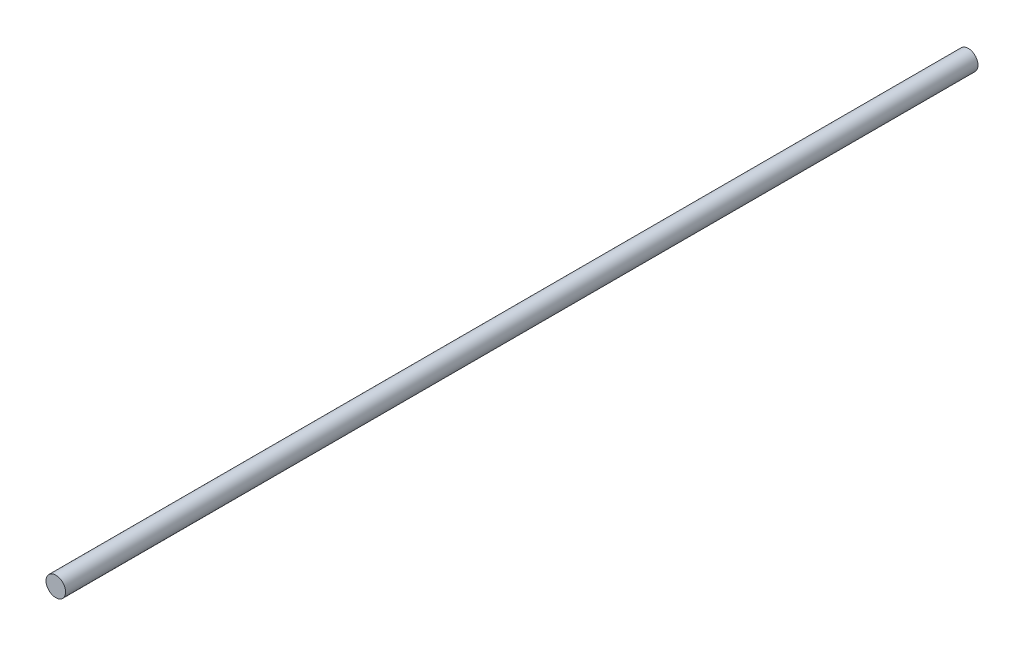
ISO-10303-21;
HEADER;
FILE_DESCRIPTION(('STEP AP214'),'2;1');
FILE_NAME('part.step','',(''),(''),'','','');
FILE_SCHEMA(('AUTOMOTIVE_DESIGN { 1 0 10303 214 1 1 1 1 }'));
ENDSEC;
DATA;
#1=APPLICATION_CONTEXT('core data for automotive mechanical design processes');
#2=APPLICATION_PROTOCOL_DEFINITION('international standard','automotive_design',2000,#1);
#3=PRODUCT_CONTEXT('',#1,'mechanical');
#4=PRODUCT('Part','Part','',(#3));
#5=PRODUCT_RELATED_PRODUCT_CATEGORY('part','',(#4));
#6=PRODUCT_DEFINITION_FORMATION('','',#4);
#7=PRODUCT_DEFINITION_CONTEXT('part definition',#1,'design');
#8=PRODUCT_DEFINITION('design','',#6,#7);
#9=PRODUCT_DEFINITION_SHAPE('','',#8);
#10=(LENGTH_UNIT() NAMED_UNIT(*) SI_UNIT(.MILLI.,.METRE.));
#11=(NAMED_UNIT(*) PLANE_ANGLE_UNIT() SI_UNIT($,.RADIAN.));
#12=(NAMED_UNIT(*) SI_UNIT($,.STERADIAN.) SOLID_ANGLE_UNIT());
#13=UNCERTAINTY_MEASURE_WITH_UNIT(LENGTH_MEASURE(1.E-05),#10,'distance_accuracy_value','');
#14=(GEOMETRIC_REPRESENTATION_CONTEXT(3) GLOBAL_UNCERTAINTY_ASSIGNED_CONTEXT((#13)) GLOBAL_UNIT_ASSIGNED_CONTEXT((#10,
#11,#12)) REPRESENTATION_CONTEXT('',''));
#15=CARTESIAN_POINT('',(0.,0.,0.));
#16=DIRECTION('',(0.,0.,1.));
#17=DIRECTION('',(1.,0.,0.));
#18=AXIS2_PLACEMENT_3D('',#15,#16,#17);
#19=CARTESIAN_POINT('',(0.,0.,259.557803239747));
#20=DIRECTION('',(0.,0.,-1.));
#21=DIRECTION('',(-1.,0.,0.));
#22=AXIS2_PLACEMENT_3D('',#19,#20,#21);
#23=CYLINDRICAL_SURFACE('',#22,3.);
#24=CARTESIAN_POINT('',(0.,0.,251.072521865509));
#25=DIRECTION('',(0.,0.,-1.));
#26=DIRECTION('',(-1.,0.,0.));
#27=AXIS2_PLACEMENT_3D('',#24,#25,#26);
#28=CIRCLE('',#27,3.);
#29=CARTESIAN_POINT('',(-3.,0.,251.072521865509));
#30=VERTEX_POINT('',#29);
#31=EDGE_CURVE('E10',#30,#30,#28,.T.);
#32=ORIENTED_EDGE('',*,*,#31,.T.);
#33=EDGE_LOOP('',(#32));
#34=FACE_BOUND('',#33,.T.);
#35=CARTESIAN_POINT('',(0.,0.,-28.9274781344912));
#36=DIRECTION('',(0.,0.,-1.));
#37=DIRECTION('',(-1.,0.,0.));
#38=AXIS2_PLACEMENT_3D('',#35,#36,#37);
#39=CIRCLE('',#38,3.);
#40=CARTESIAN_POINT('',(-3.,0.,-28.9274781344912));
#41=VERTEX_POINT('',#40);
#42=EDGE_CURVE('E44',#41,#41,#39,.F.);
#43=ORIENTED_EDGE('',*,*,#42,.T.);
#44=EDGE_LOOP('',(#43));
#45=FACE_BOUND('',#44,.T.);
#46=ADVANCED_FACE('F37',(#34,#45),#23,.T.);
#47=CARTESIAN_POINT('',(-182.059907698368,-120.37675297332,251.072521865509));
#48=DIRECTION('',(0.,0.,-1.));
#49=DIRECTION('',(-1.,0.,0.));
#50=AXIS2_PLACEMENT_3D('',#47,#48,#49);
#51=PLANE('',#50);
#52=ORIENTED_EDGE('',*,*,#31,.F.);
#53=EDGE_LOOP('',(#52));
#54=FACE_BOUND('',#53,.T.);
#55=ADVANCED_FACE('F54',(#54),#51,.F.);
#56=CARTESIAN_POINT('',(-182.059907698368,-120.37675297332,-28.9274781344912));
#57=DIRECTION('',(0.,0.,-1.));
#58=DIRECTION('',(-1.,0.,0.));
#59=AXIS2_PLACEMENT_3D('',#56,#57,#58);
#60=PLANE('',#59);
#61=ORIENTED_EDGE('',*,*,#42,.F.);
#62=EDGE_LOOP('',(#61));
#63=FACE_BOUND('',#62,.T.);
#64=ADVANCED_FACE('F52',(#63),#60,.T.);
#65=CLOSED_SHELL('',(#46,#55,#64));
#66=MANIFOLD_SOLID_BREP('B2',#65);
#67=ADVANCED_BREP_SHAPE_REPRESENTATION('',(#18,#66),#14);
#68=SHAPE_DEFINITION_REPRESENTATION(#9,#67);
ENDSEC;
END-ISO-10303-21;
